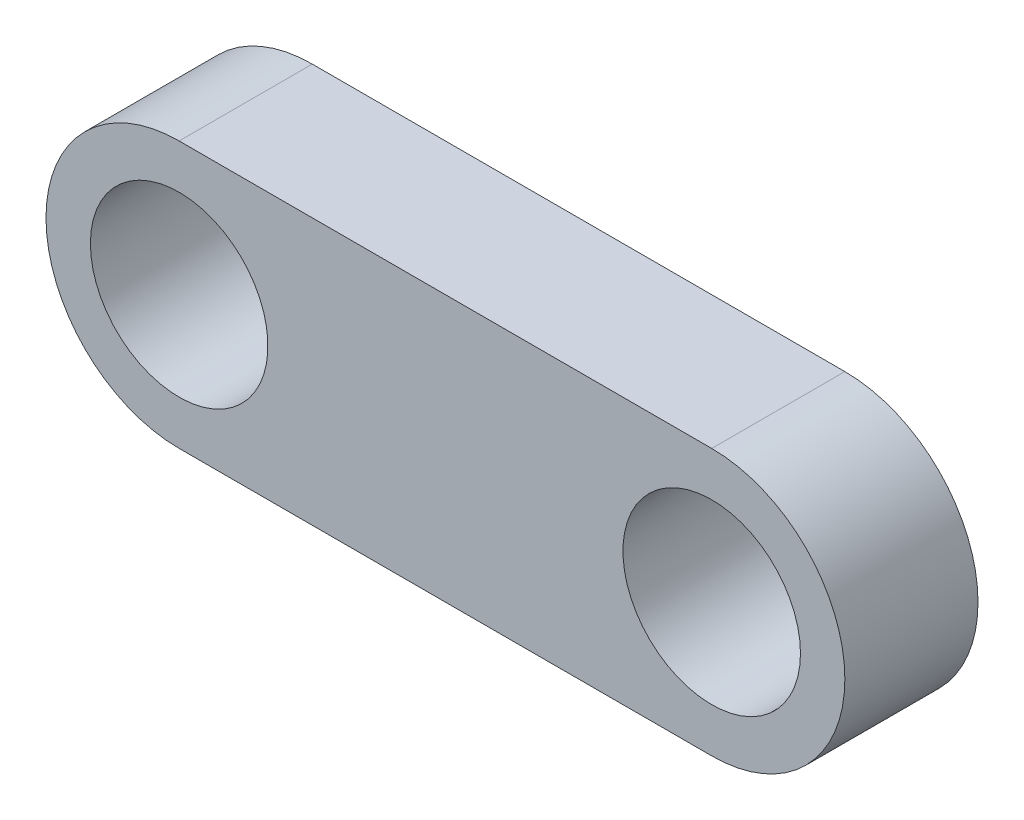
ISO-10303-21;
HEADER;
FILE_DESCRIPTION(('STEP AP214'),'2;1');
FILE_NAME('part.step','',(''),(''),'','','');
FILE_SCHEMA(('AUTOMOTIVE_DESIGN { 1 0 10303 214 1 1 1 1 }'));
ENDSEC;
DATA;
#1=APPLICATION_CONTEXT('core data for automotive mechanical design processes');
#2=APPLICATION_PROTOCOL_DEFINITION('international standard','automotive_design',2000,#1);
#3=PRODUCT_CONTEXT('',#1,'mechanical');
#4=PRODUCT('Part','Part','',(#3));
#5=PRODUCT_RELATED_PRODUCT_CATEGORY('part','',(#4));
#6=PRODUCT_DEFINITION_FORMATION('','',#4);
#7=PRODUCT_DEFINITION_CONTEXT('part definition',#1,'design');
#8=PRODUCT_DEFINITION('design','',#6,#7);
#9=PRODUCT_DEFINITION_SHAPE('','',#8);
#10=(LENGTH_UNIT() NAMED_UNIT(*) SI_UNIT(.MILLI.,.METRE.));
#11=(NAMED_UNIT(*) PLANE_ANGLE_UNIT() SI_UNIT($,.RADIAN.));
#12=(NAMED_UNIT(*) SI_UNIT($,.STERADIAN.) SOLID_ANGLE_UNIT());
#13=UNCERTAINTY_MEASURE_WITH_UNIT(LENGTH_MEASURE(1.E-05),#10,'distance_accuracy_value','');
#14=(GEOMETRIC_REPRESENTATION_CONTEXT(3) GLOBAL_UNCERTAINTY_ASSIGNED_CONTEXT((#13)) GLOBAL_UNIT_ASSIGNED_CONTEXT((#10,
#11,#12)) REPRESENTATION_CONTEXT('',''));
#15=CARTESIAN_POINT('',(0.,0.,0.));
#16=DIRECTION('',(0.,0.,1.));
#17=DIRECTION('',(1.,0.,0.));
#18=AXIS2_PLACEMENT_3D('',#15,#16,#17);
#19=CARTESIAN_POINT('',(-24.,0.,6.));
#20=DIRECTION('',(0.,0.,-1.));
#21=DIRECTION('',(-1.,0.,0.));
#22=AXIS2_PLACEMENT_3D('',#19,#20,#21);
#23=PLANE('',#22);
#24=CARTESIAN_POINT('',(-24.,0.,6.));
#25=DIRECTION('',(0.,0.,1.));
#26=DIRECTION('',(-1.,0.,0.));
#27=AXIS2_PLACEMENT_3D('',#24,#25,#26);
#28=CIRCLE('',#27,6.);
#29=CARTESIAN_POINT('',(-24.,6.,6.));
#30=VERTEX_POINT('',#29);
#31=CARTESIAN_POINT('',(-24.,-6.,6.));
#32=VERTEX_POINT('',#31);
#33=EDGE_CURVE('E88',#30,#32,#28,.T.);
#34=ORIENTED_EDGE('',*,*,#33,.T.);
#35=DIRECTION('',(1.,0.,0.));
#36=VECTOR('',#35,1.);
#37=CARTESIAN_POINT('',(-24.,-6.,6.));
#38=LINE('',#37,#36);
#39=CARTESIAN_POINT('',(0.,-6.,6.));
#40=VERTEX_POINT('',#39);
#41=EDGE_CURVE('E83',#32,#40,#38,.T.);
#42=ORIENTED_EDGE('',*,*,#41,.T.);
#43=CARTESIAN_POINT('',(0.,0.,6.));
#44=DIRECTION('',(0.,0.,1.));
#45=DIRECTION('',(1.,0.,0.));
#46=AXIS2_PLACEMENT_3D('',#43,#44,#45);
#47=CIRCLE('',#46,6.);
#48=CARTESIAN_POINT('',(0.,6.,6.));
#49=VERTEX_POINT('',#48);
#50=EDGE_CURVE('E86',#40,#49,#47,.T.);
#51=ORIENTED_EDGE('',*,*,#50,.T.);
#52=DIRECTION('',(-1.,0.,0.));
#53=VECTOR('',#52,1.);
#54=CARTESIAN_POINT('',(-24.,6.,6.));
#55=LINE('',#54,#53);
#56=EDGE_CURVE('E53',#49,#30,#55,.T.);
#57=ORIENTED_EDGE('',*,*,#56,.T.);
#58=EDGE_LOOP('',(#34,#42,#51,#57));
#59=FACE_BOUND('',#58,.T.);
#60=CARTESIAN_POINT('',(0.,0.,6.));
#61=DIRECTION('',(0.,0.,1.));
#62=DIRECTION('',(1.,0.,0.));
#63=AXIS2_PLACEMENT_3D('',#60,#61,#62);
#64=CIRCLE('',#63,4.);
#65=CARTESIAN_POINT('',(4.,0.,6.));
#66=VERTEX_POINT('',#65);
#67=EDGE_CURVE('E103',#66,#66,#64,.T.);
#68=ORIENTED_EDGE('',*,*,#67,.F.);
#69=EDGE_LOOP('',(#68));
#70=FACE_BOUND('',#69,.T.);
#71=CARTESIAN_POINT('',(-24.,0.,6.));
#72=DIRECTION('',(0.,0.,1.));
#73=DIRECTION('',(-1.,0.,0.));
#74=AXIS2_PLACEMENT_3D('',#71,#72,#73);
#75=CIRCLE('',#74,4.);
#76=CARTESIAN_POINT('',(-28.,0.,6.));
#77=VERTEX_POINT('',#76);
#78=EDGE_CURVE('E118',#77,#77,#75,.T.);
#79=ORIENTED_EDGE('',*,*,#78,.F.);
#80=EDGE_LOOP('',(#79));
#81=FACE_BOUND('',#80,.T.);
#82=ADVANCED_FACE('F36',(#59,#70,#81),#23,.F.);
#83=CARTESIAN_POINT('',(-24.,0.,0.));
#84=DIRECTION('',(0.,0.,-1.));
#85=DIRECTION('',(-1.,0.,0.));
#86=AXIS2_PLACEMENT_3D('',#83,#84,#85);
#87=PLANE('',#86);
#88=CARTESIAN_POINT('',(0.,0.,0.));
#89=DIRECTION('',(0.,0.,1.));
#90=DIRECTION('',(1.,0.,0.));
#91=AXIS2_PLACEMENT_3D('',#88,#89,#90);
#92=CIRCLE('',#91,4.);
#93=CARTESIAN_POINT('',(4.,0.,0.));
#94=VERTEX_POINT('',#93);
#95=EDGE_CURVE('E115',#94,#94,#92,.T.);
#96=ORIENTED_EDGE('',*,*,#95,.T.);
#97=EDGE_LOOP('',(#96));
#98=FACE_BOUND('',#97,.T.);
#99=CARTESIAN_POINT('',(-24.,0.,0.));
#100=DIRECTION('',(0.,0.,1.));
#101=DIRECTION('',(-1.,0.,0.));
#102=AXIS2_PLACEMENT_3D('',#99,#100,#101);
#103=CIRCLE('',#102,6.);
#104=CARTESIAN_POINT('',(-24.,6.,0.));
#105=VERTEX_POINT('',#104);
#106=CARTESIAN_POINT('',(-24.,-6.,0.));
#107=VERTEX_POINT('',#106);
#108=EDGE_CURVE('E100',#105,#107,#103,.T.);
#109=ORIENTED_EDGE('',*,*,#108,.F.);
#110=DIRECTION('',(-1.,0.,0.));
#111=VECTOR('',#110,1.);
#112=CARTESIAN_POINT('',(-24.,6.,0.));
#113=LINE('',#112,#111);
#114=CARTESIAN_POINT('',(0.,6.,0.));
#115=VERTEX_POINT('',#114);
#116=EDGE_CURVE('E76',#115,#105,#113,.T.);
#117=ORIENTED_EDGE('',*,*,#116,.F.);
#118=CARTESIAN_POINT('',(0.,0.,0.));
#119=DIRECTION('',(0.,0.,1.));
#120=DIRECTION('',(1.,0.,0.));
#121=AXIS2_PLACEMENT_3D('',#118,#119,#120);
#122=CIRCLE('',#121,6.);
#123=CARTESIAN_POINT('',(0.,-6.,0.));
#124=VERTEX_POINT('',#123);
#125=EDGE_CURVE('E70',#124,#115,#122,.T.);
#126=ORIENTED_EDGE('',*,*,#125,.F.);
#127=DIRECTION('',(1.,0.,0.));
#128=VECTOR('',#127,1.);
#129=CARTESIAN_POINT('',(-24.,-6.,0.));
#130=LINE('',#129,#128);
#131=EDGE_CURVE('E92',#107,#124,#130,.T.);
#132=ORIENTED_EDGE('',*,*,#131,.F.);
#133=EDGE_LOOP('',(#109,#117,#126,#132));
#134=FACE_BOUND('',#133,.T.);
#135=CARTESIAN_POINT('',(-24.,0.,0.));
#136=DIRECTION('',(0.,0.,1.));
#137=DIRECTION('',(-1.,0.,0.));
#138=AXIS2_PLACEMENT_3D('',#135,#136,#137);
#139=CIRCLE('',#138,4.);
#140=CARTESIAN_POINT('',(-28.,0.,0.));
#141=VERTEX_POINT('',#140);
#142=EDGE_CURVE('E121',#141,#141,#139,.T.);
#143=ORIENTED_EDGE('',*,*,#142,.T.);
#144=EDGE_LOOP('',(#143));
#145=FACE_BOUND('',#144,.T.);
#146=ADVANCED_FACE('F111',(#98,#134,#145),#87,.T.);
#147=CARTESIAN_POINT('',(-24.,0.,6.));
#148=DIRECTION('',(0.,0.,-1.));
#149=DIRECTION('',(-1.,0.,0.));
#150=AXIS2_PLACEMENT_3D('',#147,#148,#149);
#151=CYLINDRICAL_SURFACE('',#150,6.);
#152=ORIENTED_EDGE('',*,*,#108,.T.);
#153=DIRECTION('',(0.,0.,-1.));
#154=VECTOR('',#153,1.);
#155=CARTESIAN_POINT('',(-24.,-6.,6.));
#156=LINE('',#155,#154);
#157=EDGE_CURVE('E11',#32,#107,#156,.T.);
#158=ORIENTED_EDGE('',*,*,#157,.F.);
#159=ORIENTED_EDGE('',*,*,#33,.F.);
#160=DIRECTION('',(0.,0.,-1.));
#161=VECTOR('',#160,1.);
#162=CARTESIAN_POINT('',(-24.,6.,6.));
#163=LINE('',#162,#161);
#164=EDGE_CURVE('E96',#30,#105,#163,.T.);
#165=ORIENTED_EDGE('',*,*,#164,.T.);
#166=EDGE_LOOP('',(#152,#158,#159,#165));
#167=FACE_BOUND('',#166,.T.);
#168=ADVANCED_FACE('F38',(#167),#151,.T.);
#169=CARTESIAN_POINT('',(-24.,-6.,6.));
#170=DIRECTION('',(0.,1.,0.));
#171=DIRECTION('',(-1.,0.,0.));
#172=AXIS2_PLACEMENT_3D('',#169,#170,#171);
#173=PLANE('',#172);
#174=ORIENTED_EDGE('',*,*,#131,.T.);
#175=DIRECTION('',(0.,0.,-1.));
#176=VECTOR('',#175,1.);
#177=CARTESIAN_POINT('',(0.,-6.,6.));
#178=LINE('',#177,#176);
#179=EDGE_CURVE('E45',#40,#124,#178,.T.);
#180=ORIENTED_EDGE('',*,*,#179,.F.);
#181=ORIENTED_EDGE('',*,*,#41,.F.);
#182=ORIENTED_EDGE('',*,*,#157,.T.);
#183=EDGE_LOOP('',(#174,#180,#181,#182));
#184=FACE_BOUND('',#183,.T.);
#185=ADVANCED_FACE('F91',(#184),#173,.F.);
#186=CARTESIAN_POINT('',(0.,0.,6.));
#187=DIRECTION('',(0.,0.,-1.));
#188=DIRECTION('',(-1.,0.,0.));
#189=AXIS2_PLACEMENT_3D('',#186,#187,#188);
#190=CYLINDRICAL_SURFACE('',#189,6.);
#191=ORIENTED_EDGE('',*,*,#125,.T.);
#192=DIRECTION('',(0.,0.,-1.));
#193=VECTOR('',#192,1.);
#194=CARTESIAN_POINT('',(0.,6.,6.));
#195=LINE('',#194,#193);
#196=EDGE_CURVE('E93',#49,#115,#195,.T.);
#197=ORIENTED_EDGE('',*,*,#196,.F.);
#198=ORIENTED_EDGE('',*,*,#50,.F.);
#199=ORIENTED_EDGE('',*,*,#179,.T.);
#200=EDGE_LOOP('',(#191,#197,#198,#199));
#201=FACE_BOUND('',#200,.T.);
#202=ADVANCED_FACE('F94',(#201),#190,.T.);
#203=CARTESIAN_POINT('',(-24.,6.,6.));
#204=DIRECTION('',(0.,-1.,0.));
#205=DIRECTION('',(1.,0.,0.));
#206=AXIS2_PLACEMENT_3D('',#203,#204,#205);
#207=PLANE('',#206);
#208=ORIENTED_EDGE('',*,*,#116,.T.);
#209=ORIENTED_EDGE('',*,*,#164,.F.);
#210=ORIENTED_EDGE('',*,*,#56,.F.);
#211=ORIENTED_EDGE('',*,*,#196,.T.);
#212=EDGE_LOOP('',(#208,#209,#210,#211));
#213=FACE_BOUND('',#212,.T.);
#214=ADVANCED_FACE('F108',(#213),#207,.F.);
#215=CARTESIAN_POINT('',(0.,0.,6.));
#216=DIRECTION('',(0.,0.,-1.));
#217=DIRECTION('',(-1.,0.,0.));
#218=AXIS2_PLACEMENT_3D('',#215,#216,#217);
#219=CYLINDRICAL_SURFACE('',#218,4.);
#220=ORIENTED_EDGE('',*,*,#67,.T.);
#221=EDGE_LOOP('',(#220));
#222=FACE_BOUND('',#221,.T.);
#223=ORIENTED_EDGE('',*,*,#95,.F.);
#224=EDGE_LOOP('',(#223));
#225=FACE_BOUND('',#224,.T.);
#226=ADVANCED_FACE('F138',(#222,#225),#219,.F.);
#227=CARTESIAN_POINT('',(-24.,0.,6.));
#228=DIRECTION('',(0.,0.,-1.));
#229=DIRECTION('',(-1.,0.,0.));
#230=AXIS2_PLACEMENT_3D('',#227,#228,#229);
#231=CYLINDRICAL_SURFACE('',#230,4.);
#232=ORIENTED_EDGE('',*,*,#78,.T.);
#233=EDGE_LOOP('',(#232));
#234=FACE_BOUND('',#233,.T.);
#235=ORIENTED_EDGE('',*,*,#142,.F.);
#236=EDGE_LOOP('',(#235));
#237=FACE_BOUND('',#236,.T.);
#238=ADVANCED_FACE('F127',(#234,#237),#231,.F.);
#239=CLOSED_SHELL('',(#82,#146,#168,#185,#202,#214,#226,#238));
#240=MANIFOLD_SOLID_BREP('B2',#239);
#241=ADVANCED_BREP_SHAPE_REPRESENTATION('',(#18,#240),#14);
#242=SHAPE_DEFINITION_REPRESENTATION(#9,#241);
ENDSEC;
END-ISO-10303-21;
